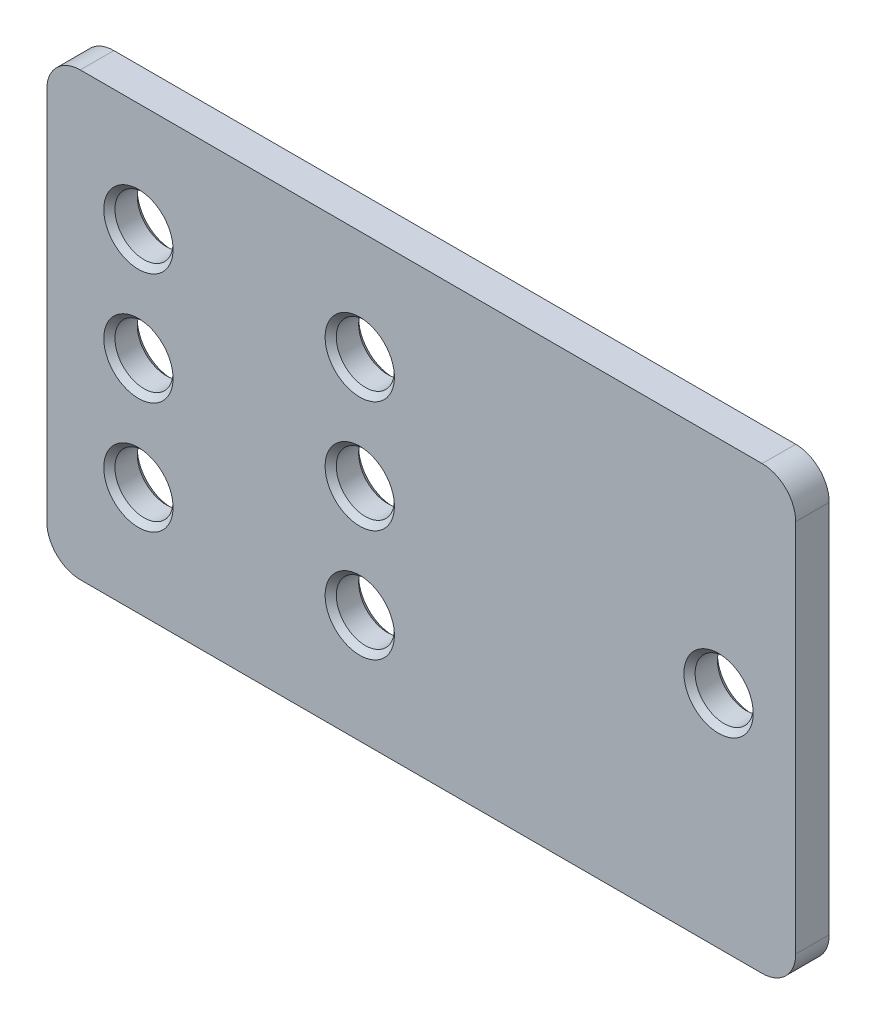
ISO-10303-21;
HEADER;
FILE_DESCRIPTION(('STEP AP214'),'2;1');
FILE_NAME('part.step','',(''),(''),'','','');
FILE_SCHEMA(('AUTOMOTIVE_DESIGN { 1 0 10303 214 1 1 1 1 }'));
ENDSEC;
DATA;
#1=APPLICATION_CONTEXT('core data for automotive mechanical design processes');
#2=APPLICATION_PROTOCOL_DEFINITION('international standard','automotive_design',2000,#1);
#3=PRODUCT_CONTEXT('',#1,'mechanical');
#4=PRODUCT('Part','Part','',(#3));
#5=PRODUCT_RELATED_PRODUCT_CATEGORY('part','',(#4));
#6=PRODUCT_DEFINITION_FORMATION('','',#4);
#7=PRODUCT_DEFINITION_CONTEXT('part definition',#1,'design');
#8=PRODUCT_DEFINITION('design','',#6,#7);
#9=PRODUCT_DEFINITION_SHAPE('','',#8);
#10=(LENGTH_UNIT() NAMED_UNIT(*) SI_UNIT(.MILLI.,.METRE.));
#11=(NAMED_UNIT(*) PLANE_ANGLE_UNIT() SI_UNIT($,.RADIAN.));
#12=(NAMED_UNIT(*) SI_UNIT($,.STERADIAN.) SOLID_ANGLE_UNIT());
#13=UNCERTAINTY_MEASURE_WITH_UNIT(LENGTH_MEASURE(1.E-05),#10,'distance_accuracy_value','');
#14=(GEOMETRIC_REPRESENTATION_CONTEXT(3) GLOBAL_UNCERTAINTY_ASSIGNED_CONTEXT((#13)) GLOBAL_UNIT_ASSIGNED_CONTEXT((#10,
#11,#12)) REPRESENTATION_CONTEXT('',''));
#15=CARTESIAN_POINT('',(0.,0.,0.));
#16=DIRECTION('',(0.,0.,1.));
#17=DIRECTION('',(1.,0.,0.));
#18=AXIS2_PLACEMENT_3D('',#15,#16,#17);
#19=CARTESIAN_POINT('',(28.5656984456913,19.4772315369713,0.702674315881723));
#20=DIRECTION('',(0.,0.,-1.));
#21=DIRECTION('',(-1.,0.,0.));
#22=AXIS2_PLACEMENT_3D('',#19,#20,#21);
#23=PLANE('',#22);
#24=CARTESIAN_POINT('',(-27.2318818992247,12.7296511920554,0.702674315881723));
#25=DIRECTION('',(0.,0.,-1.));
#26=DIRECTION('',(-1.,0.,0.));
#27=AXIS2_PLACEMENT_3D('',#24,#25,#26);
#28=CIRCLE('',#27,3.10000000000002);
#29=CARTESIAN_POINT('',(-30.3318818992247,12.7296511920554,0.702674315881723));
#30=VERTEX_POINT('',#29);
#31=EDGE_CURVE('E166',#30,#30,#28,.T.);
#32=ORIENTED_EDGE('',*,*,#31,.T.);
#33=EDGE_LOOP('',(#32));
#34=FACE_BOUND('',#33,.T.);
#35=CARTESIAN_POINT('',(-27.2318818992247,2.72965119205537,0.702674315881723));
#36=DIRECTION('',(0.,0.,-1.));
#37=DIRECTION('',(-1.,0.,0.));
#38=AXIS2_PLACEMENT_3D('',#35,#36,#37);
#39=CIRCLE('',#38,3.10000000000002);
#40=CARTESIAN_POINT('',(-30.3318818992247,2.72965119205537,0.702674315881723));
#41=VERTEX_POINT('',#40);
#42=EDGE_CURVE('E163',#41,#41,#39,.T.);
#43=ORIENTED_EDGE('',*,*,#42,.T.);
#44=EDGE_LOOP('',(#43));
#45=FACE_BOUND('',#44,.T.);
#46=CARTESIAN_POINT('',(-27.2318818992247,-7.27034880794463,0.702674315881723));
#47=DIRECTION('',(0.,0.,-1.));
#48=DIRECTION('',(-1.,0.,0.));
#49=AXIS2_PLACEMENT_3D('',#46,#47,#48);
#50=CIRCLE('',#49,3.10000000000002);
#51=CARTESIAN_POINT('',(-30.3318818992247,-7.27034880794463,0.702674315881723));
#52=VERTEX_POINT('',#51);
#53=EDGE_CURVE('E160',#52,#52,#50,.T.);
#54=ORIENTED_EDGE('',*,*,#53,.T.);
#55=EDGE_LOOP('',(#54));
#56=FACE_BOUND('',#55,.T.);
#57=CARTESIAN_POINT('',(24.6681181007753,2.72965119205537,0.702674315881723));
#58=DIRECTION('',(0.,0.,-1.));
#59=DIRECTION('',(-1.,0.,0.));
#60=AXIS2_PLACEMENT_3D('',#57,#58,#59);
#61=CIRCLE('',#60,3.10000000000001);
#62=CARTESIAN_POINT('',(21.5681181007753,2.72965119205537,0.702674315881723));
#63=VERTEX_POINT('',#62);
#64=EDGE_CURVE('E157',#63,#63,#61,.T.);
#65=ORIENTED_EDGE('',*,*,#64,.T.);
#66=EDGE_LOOP('',(#65));
#67=FACE_BOUND('',#66,.T.);
#68=CARTESIAN_POINT('',(-7.43188189922467,2.72965119205537,0.702674315881723));
#69=DIRECTION('',(0.,0.,-1.));
#70=DIRECTION('',(-1.,0.,0.));
#71=AXIS2_PLACEMENT_3D('',#68,#69,#70);
#72=CIRCLE('',#71,3.09999999999998);
#73=CARTESIAN_POINT('',(-10.5318818992246,2.72965119205537,0.702674315881723));
#74=VERTEX_POINT('',#73);
#75=EDGE_CURVE('E154',#74,#74,#72,.T.);
#76=ORIENTED_EDGE('',*,*,#75,.T.);
#77=EDGE_LOOP('',(#76));
#78=FACE_BOUND('',#77,.T.);
#79=CARTESIAN_POINT('',(-7.43188189922467,12.7296511920554,0.702674315881723));
#80=DIRECTION('',(0.,0.,-1.));
#81=DIRECTION('',(-1.,0.,0.));
#82=AXIS2_PLACEMENT_3D('',#79,#80,#81);
#83=CIRCLE('',#82,3.09999999999998);
#84=CARTESIAN_POINT('',(-10.5318818992246,12.7296511920554,0.702674315881723));
#85=VERTEX_POINT('',#84);
#86=EDGE_CURVE('E151',#85,#85,#83,.T.);
#87=ORIENTED_EDGE('',*,*,#86,.T.);
#88=EDGE_LOOP('',(#87));
#89=FACE_BOUND('',#88,.T.);
#90=CARTESIAN_POINT('',(-7.43188189922466,-7.27034880794463,0.702674315881723));
#91=DIRECTION('',(0.,0.,-1.));
#92=DIRECTION('',(-1.,0.,0.));
#93=AXIS2_PLACEMENT_3D('',#90,#91,#92);
#94=CIRCLE('',#93,3.10000000000001);
#95=CARTESIAN_POINT('',(-10.5318818992247,-7.27034880794463,0.702674315881723));
#96=VERTEX_POINT('',#95);
#97=EDGE_CURVE('E148',#96,#96,#94,.T.);
#98=ORIENTED_EDGE('',*,*,#97,.T.);
#99=EDGE_LOOP('',(#98));
#100=FACE_BOUND('',#99,.T.);
#101=CARTESIAN_POINT('',(28.5656984456913,19.4772315369713,0.702674315881723));
#102=DIRECTION('',(0.,0.,1.));
#103=DIRECTION('',(-1.,0.,0.));
#104=AXIS2_PLACEMENT_3D('',#101,#102,#103);
#105=CIRCLE('',#104,3.00241965508409);
#106=CARTESIAN_POINT('',(31.5681181007753,19.4772315369713,0.702674315881723));
#107=VERTEX_POINT('',#106);
#108=CARTESIAN_POINT('',(28.5656984456912,22.4796511920554,0.702674315881723));
#109=VERTEX_POINT('',#108);
#110=EDGE_CURVE('E127',#107,#109,#105,.T.);
#111=ORIENTED_EDGE('',*,*,#110,.T.);
#112=DIRECTION('',(-1.,0.,0.));
#113=VECTOR('',#112,1.);
#114=CARTESIAN_POINT('',(-32.4294622441406,22.4796511920554,0.702674315881723));
#115=LINE('',#114,#113);
#116=CARTESIAN_POINT('',(-32.4294622441406,22.4796511920554,0.702674315881723));
#117=VERTEX_POINT('',#116);
#118=EDGE_CURVE('E77',#109,#117,#115,.T.);
#119=ORIENTED_EDGE('',*,*,#118,.T.);
#120=CARTESIAN_POINT('',(-32.4294622441406,19.4772315369713,0.702674315881723));
#121=DIRECTION('',(0.,0.,1.));
#122=DIRECTION('',(-1.,0.,0.));
#123=AXIS2_PLACEMENT_3D('',#120,#121,#122);
#124=CIRCLE('',#123,3.00241965508409);
#125=CARTESIAN_POINT('',(-35.4318818992247,19.4772315369713,0.702674315881723));
#126=VERTEX_POINT('',#125);
#127=EDGE_CURVE('E336',#117,#126,#124,.T.);
#128=ORIENTED_EDGE('',*,*,#127,.T.);
#129=DIRECTION('',(0.,-1.,0.));
#130=VECTOR('',#129,1.);
#131=CARTESIAN_POINT('',(-35.4318818992247,19.4772315369713,0.702674315881723));
#132=LINE('',#131,#130);
#133=CARTESIAN_POINT('',(-35.4318818992247,-14.0179291528605,0.702674315881723));
#134=VERTEX_POINT('',#133);
#135=EDGE_CURVE('E340',#126,#134,#132,.T.);
#136=ORIENTED_EDGE('',*,*,#135,.T.);
#137=CARTESIAN_POINT('',(-32.4294622441406,-14.0179291528605,0.702674315881723));
#138=DIRECTION('',(0.,0.,1.));
#139=DIRECTION('',(-1.,0.,0.));
#140=AXIS2_PLACEMENT_3D('',#137,#138,#139);
#141=CIRCLE('',#140,3.00241965508409);
#142=CARTESIAN_POINT('',(-32.4294622441406,-17.0203488079446,0.702674315881723));
#143=VERTEX_POINT('',#142);
#144=EDGE_CURVE('E95',#134,#143,#141,.T.);
#145=ORIENTED_EDGE('',*,*,#144,.T.);
#146=DIRECTION('',(1.,0.,0.));
#147=VECTOR('',#146,1.);
#148=CARTESIAN_POINT('',(-32.4294622441406,-17.0203488079446,0.702674315881723));
#149=LINE('',#148,#147);
#150=CARTESIAN_POINT('',(28.5656984456912,-17.0203488079446,0.702674315881723));
#151=VERTEX_POINT('',#150);
#152=EDGE_CURVE('E90',#143,#151,#149,.T.);
#153=ORIENTED_EDGE('',*,*,#152,.T.);
#154=CARTESIAN_POINT('',(28.5656984456913,-14.0179291528605,0.702674315881723));
#155=DIRECTION('',(0.,0.,1.));
#156=DIRECTION('',(-1.,0.,0.));
#157=AXIS2_PLACEMENT_3D('',#154,#155,#156);
#158=CIRCLE('',#157,3.00241965508409);
#159=CARTESIAN_POINT('',(31.5681181007753,-14.0179291528605,0.702674315881723));
#160=VERTEX_POINT('',#159);
#161=EDGE_CURVE('E93',#151,#160,#158,.T.);
#162=ORIENTED_EDGE('',*,*,#161,.T.);
#163=DIRECTION('',(0.,1.,0.));
#164=VECTOR('',#163,1.);
#165=CARTESIAN_POINT('',(31.5681181007753,19.4772315369713,0.702674315881723));
#166=LINE('',#165,#164);
#167=EDGE_CURVE('E33',#160,#107,#166,.T.);
#168=ORIENTED_EDGE('',*,*,#167,.T.);
#169=EDGE_LOOP('',(#111,#119,#128,#136,#145,#153,#162,#168));
#170=FACE_BOUND('',#169,.T.);
#171=ADVANCED_FACE('F16',(#34,#45,#56,#67,#78,#89,#100,#170),#23,.F.);
#172=CARTESIAN_POINT('',(28.5656984456913,19.4772315369713,-2.29732568411828));
#173=DIRECTION('',(0.,0.,-1.));
#174=DIRECTION('',(-1.,0.,0.));
#175=AXIS2_PLACEMENT_3D('',#172,#173,#174);
#176=PLANE('',#175);
#177=CARTESIAN_POINT('',(-7.43188189922467,12.7296511920554,-2.29732568411828));
#178=DIRECTION('',(0.,0.,-1.));
#179=DIRECTION('',(-1.,0.,0.));
#180=AXIS2_PLACEMENT_3D('',#177,#178,#179);
#181=CIRCLE('',#180,3.1);
#182=CARTESIAN_POINT('',(-10.5318818992247,12.7296511920554,-2.29732568411828));
#183=VERTEX_POINT('',#182);
#184=EDGE_CURVE('E10',#183,#183,#181,.F.);
#185=ORIENTED_EDGE('',*,*,#184,.T.);
#186=EDGE_LOOP('',(#185));
#187=FACE_BOUND('',#186,.T.);
#188=CARTESIAN_POINT('',(-27.2318818992247,12.7296511920554,-2.29732568411828));
#189=DIRECTION('',(0.,0.,-1.));
#190=DIRECTION('',(-1.,0.,0.));
#191=AXIS2_PLACEMENT_3D('',#188,#189,#190);
#192=CIRCLE('',#191,3.09999999999998);
#193=CARTESIAN_POINT('',(-30.3318818992247,12.7296511920554,-2.29732568411828));
#194=VERTEX_POINT('',#193);
#195=EDGE_CURVE('E25',#194,#194,#192,.F.);
#196=ORIENTED_EDGE('',*,*,#195,.T.);
#197=EDGE_LOOP('',(#196));
#198=FACE_BOUND('',#197,.T.);
#199=CARTESIAN_POINT('',(-27.2318818992247,2.72965119205537,-2.29732568411828));
#200=DIRECTION('',(0.,0.,-1.));
#201=DIRECTION('',(-1.,0.,0.));
#202=AXIS2_PLACEMENT_3D('',#199,#200,#201);
#203=CIRCLE('',#202,3.09999999999998);
#204=CARTESIAN_POINT('',(-30.3318818992247,2.72965119205537,-2.29732568411828));
#205=VERTEX_POINT('',#204);
#206=EDGE_CURVE('E217',#205,#205,#203,.F.);
#207=ORIENTED_EDGE('',*,*,#206,.T.);
#208=EDGE_LOOP('',(#207));
#209=FACE_BOUND('',#208,.T.);
#210=CARTESIAN_POINT('',(-7.43188189922467,2.72965119205537,-2.29732568411828));
#211=DIRECTION('',(0.,0.,-1.));
#212=DIRECTION('',(-1.,0.,0.));
#213=AXIS2_PLACEMENT_3D('',#210,#211,#212);
#214=CIRCLE('',#213,3.1);
#215=CARTESIAN_POINT('',(-10.5318818992247,2.72965119205537,-2.29732568411828));
#216=VERTEX_POINT('',#215);
#217=EDGE_CURVE('E214',#216,#216,#214,.F.);
#218=ORIENTED_EDGE('',*,*,#217,.T.);
#219=EDGE_LOOP('',(#218));
#220=FACE_BOUND('',#219,.T.);
#221=CARTESIAN_POINT('',(24.6681181007753,2.72965119205537,-2.29732568411828));
#222=DIRECTION('',(0.,0.,-1.));
#223=DIRECTION('',(-1.,0.,0.));
#224=AXIS2_PLACEMENT_3D('',#221,#222,#223);
#225=CIRCLE('',#224,3.09999999999998);
#226=CARTESIAN_POINT('',(21.5681181007754,2.72965119205537,-2.29732568411828));
#227=VERTEX_POINT('',#226);
#228=EDGE_CURVE('E211',#227,#227,#225,.F.);
#229=ORIENTED_EDGE('',*,*,#228,.T.);
#230=EDGE_LOOP('',(#229));
#231=FACE_BOUND('',#230,.T.);
#232=CARTESIAN_POINT('',(-7.43188189922466,-7.27034880794463,-2.29732568411828));
#233=DIRECTION('',(0.,0.,-1.));
#234=DIRECTION('',(-1.,0.,0.));
#235=AXIS2_PLACEMENT_3D('',#232,#233,#234);
#236=CIRCLE('',#235,3.1);
#237=CARTESIAN_POINT('',(-10.5318818992247,-7.27034880794463,-2.29732568411828));
#238=VERTEX_POINT('',#237);
#239=EDGE_CURVE('E208',#238,#238,#236,.F.);
#240=ORIENTED_EDGE('',*,*,#239,.T.);
#241=EDGE_LOOP('',(#240));
#242=FACE_BOUND('',#241,.T.);
#243=CARTESIAN_POINT('',(-27.2318818992247,-7.27034880794463,-2.29732568411828));
#244=DIRECTION('',(0.,0.,-1.));
#245=DIRECTION('',(-1.,0.,0.));
#246=AXIS2_PLACEMENT_3D('',#243,#244,#245);
#247=CIRCLE('',#246,3.09999999999998);
#248=CARTESIAN_POINT('',(-30.3318818992246,-7.27034880794463,-2.29732568411828));
#249=VERTEX_POINT('',#248);
#250=EDGE_CURVE('E205',#249,#249,#247,.F.);
#251=ORIENTED_EDGE('',*,*,#250,.T.);
#252=EDGE_LOOP('',(#251));
#253=FACE_BOUND('',#252,.T.);
#254=CARTESIAN_POINT('',(28.5656984456913,19.4772315369713,-2.29732568411828));
#255=DIRECTION('',(0.,0.,1.));
#256=DIRECTION('',(-1.,0.,0.));
#257=AXIS2_PLACEMENT_3D('',#254,#255,#256);
#258=CIRCLE('',#257,3.00241965508409);
#259=CARTESIAN_POINT('',(31.5681181007753,19.4772315369713,-2.29732568411828));
#260=VERTEX_POINT('',#259);
#261=CARTESIAN_POINT('',(28.5656984456912,22.4796511920554,-2.29732568411828));
#262=VERTEX_POINT('',#261);
#263=EDGE_CURVE('E113',#260,#262,#258,.T.);
#264=ORIENTED_EDGE('',*,*,#263,.F.);
#265=DIRECTION('',(0.,1.,0.));
#266=VECTOR('',#265,1.);
#267=CARTESIAN_POINT('',(31.5681181007753,19.4772315369713,-2.29732568411828));
#268=LINE('',#267,#266);
#269=CARTESIAN_POINT('',(31.5681181007753,-14.0179291528605,-2.29732568411828));
#270=VERTEX_POINT('',#269);
#271=EDGE_CURVE('E68',#270,#260,#268,.T.);
#272=ORIENTED_EDGE('',*,*,#271,.F.);
#273=CARTESIAN_POINT('',(28.5656984456913,-14.0179291528605,-2.29732568411828));
#274=DIRECTION('',(0.,0.,1.));
#275=DIRECTION('',(-1.,0.,0.));
#276=AXIS2_PLACEMENT_3D('',#273,#274,#275);
#277=CIRCLE('',#276,3.00241965508409);
#278=CARTESIAN_POINT('',(28.5656984456912,-17.0203488079446,-2.29732568411828));
#279=VERTEX_POINT('',#278);
#280=EDGE_CURVE('E62',#279,#270,#277,.T.);
#281=ORIENTED_EDGE('',*,*,#280,.F.);
#282=DIRECTION('',(1.,0.,0.));
#283=VECTOR('',#282,1.);
#284=CARTESIAN_POINT('',(-32.4294622441406,-17.0203488079446,-2.29732568411828));
#285=LINE('',#284,#283);
#286=CARTESIAN_POINT('',(-32.4294622441406,-17.0203488079446,-2.29732568411828));
#287=VERTEX_POINT('',#286);
#288=EDGE_CURVE('E103',#287,#279,#285,.T.);
#289=ORIENTED_EDGE('',*,*,#288,.F.);
#290=CARTESIAN_POINT('',(-32.4294622441406,-14.0179291528605,-2.29732568411828));
#291=DIRECTION('',(0.,0.,1.));
#292=DIRECTION('',(-1.,0.,0.));
#293=AXIS2_PLACEMENT_3D('',#290,#291,#292);
#294=CIRCLE('',#293,3.00241965508409);
#295=CARTESIAN_POINT('',(-35.4318818992247,-14.0179291528605,-2.29732568411828));
#296=VERTEX_POINT('',#295);
#297=EDGE_CURVE('E122',#296,#287,#294,.T.);
#298=ORIENTED_EDGE('',*,*,#297,.F.);
#299=DIRECTION('',(0.,-1.,0.));
#300=VECTOR('',#299,1.);
#301=CARTESIAN_POINT('',(-35.4318818992247,19.4772315369713,-2.29732568411828));
#302=LINE('',#301,#300);
#303=CARTESIAN_POINT('',(-35.4318818992247,19.4772315369713,-2.29732568411828));
#304=VERTEX_POINT('',#303);
#305=EDGE_CURVE('E120',#304,#296,#302,.T.);
#306=ORIENTED_EDGE('',*,*,#305,.F.);
#307=CARTESIAN_POINT('',(-32.4294622441406,19.4772315369713,-2.29732568411828));
#308=DIRECTION('',(0.,0.,1.));
#309=DIRECTION('',(-1.,0.,0.));
#310=AXIS2_PLACEMENT_3D('',#307,#308,#309);
#311=CIRCLE('',#310,3.00241965508409);
#312=CARTESIAN_POINT('',(-32.4294622441406,22.4796511920554,-2.29732568411828));
#313=VERTEX_POINT('',#312);
#314=EDGE_CURVE('E118',#313,#304,#311,.T.);
#315=ORIENTED_EDGE('',*,*,#314,.F.);
#316=DIRECTION('',(-1.,0.,0.));
#317=VECTOR('',#316,1.);
#318=CARTESIAN_POINT('',(-32.4294622441406,22.4796511920554,-2.29732568411828));
#319=LINE('',#318,#317);
#320=EDGE_CURVE('E116',#262,#313,#319,.T.);
#321=ORIENTED_EDGE('',*,*,#320,.F.);
#322=EDGE_LOOP('',(#264,#272,#281,#289,#298,#306,#315,#321));
#323=FACE_BOUND('',#322,.T.);
#324=ADVANCED_FACE('F222',(#187,#198,#209,#220,#231,#242,#253,#323),#176,.T.);
#325=CARTESIAN_POINT('',(28.5656984456913,19.4772315369713,0.702674315881723));
#326=DIRECTION('',(0.,0.,-1.));
#327=DIRECTION('',(-1.,0.,0.));
#328=AXIS2_PLACEMENT_3D('',#325,#326,#327);
#329=CYLINDRICAL_SURFACE('',#328,3.00241965508409);
#330=ORIENTED_EDGE('',*,*,#263,.T.);
#331=DIRECTION('',(0.,0.,-1.));
#332=VECTOR('',#331,1.);
#333=CARTESIAN_POINT('',(28.5656984456912,22.4796511920554,0.702674315881723));
#334=LINE('',#333,#332);
#335=EDGE_CURVE('E140',#109,#262,#334,.T.);
#336=ORIENTED_EDGE('',*,*,#335,.F.);
#337=ORIENTED_EDGE('',*,*,#110,.F.);
#338=DIRECTION('',(0.,0.,-1.));
#339=VECTOR('',#338,1.);
#340=CARTESIAN_POINT('',(31.5681181007753,19.4772315369713,0.702674315881723));
#341=LINE('',#340,#339);
#342=EDGE_CURVE('E109',#107,#260,#341,.T.);
#343=ORIENTED_EDGE('',*,*,#342,.T.);
#344=EDGE_LOOP('',(#330,#336,#337,#343));
#345=FACE_BOUND('',#344,.T.);
#346=ADVANCED_FACE('F249',(#345),#329,.T.);
#347=CARTESIAN_POINT('',(-32.4294622441406,22.4796511920554,0.702674315881723));
#348=DIRECTION('',(0.,-1.,0.));
#349=DIRECTION('',(0.,0.,-1.));
#350=AXIS2_PLACEMENT_3D('',#347,#348,#349);
#351=PLANE('',#350);
#352=ORIENTED_EDGE('',*,*,#320,.T.);
#353=DIRECTION('',(0.,0.,-1.));
#354=VECTOR('',#353,1.);
#355=CARTESIAN_POINT('',(-32.4294622441406,22.4796511920554,0.702674315881723));
#356=LINE('',#355,#354);
#357=EDGE_CURVE('E137',#117,#313,#356,.T.);
#358=ORIENTED_EDGE('',*,*,#357,.F.);
#359=ORIENTED_EDGE('',*,*,#118,.F.);
#360=ORIENTED_EDGE('',*,*,#335,.T.);
#361=EDGE_LOOP('',(#352,#358,#359,#360));
#362=FACE_BOUND('',#361,.T.);
#363=ADVANCED_FACE('F275',(#362),#351,.F.);
#364=CARTESIAN_POINT('',(-32.4294622441406,19.4772315369713,0.702674315881723));
#365=DIRECTION('',(0.,0.,-1.));
#366=DIRECTION('',(-1.,0.,0.));
#367=AXIS2_PLACEMENT_3D('',#364,#365,#366);
#368=CYLINDRICAL_SURFACE('',#367,3.00241965508409);
#369=ORIENTED_EDGE('',*,*,#314,.T.);
#370=DIRECTION('',(0.,0.,-1.));
#371=VECTOR('',#370,1.);
#372=CARTESIAN_POINT('',(-35.4318818992247,19.4772315369713,0.702674315881723));
#373=LINE('',#372,#371);
#374=EDGE_CURVE('E134',#126,#304,#373,.T.);
#375=ORIENTED_EDGE('',*,*,#374,.F.);
#376=ORIENTED_EDGE('',*,*,#127,.F.);
#377=ORIENTED_EDGE('',*,*,#357,.T.);
#378=EDGE_LOOP('',(#369,#375,#376,#377));
#379=FACE_BOUND('',#378,.T.);
#380=ADVANCED_FACE('F271',(#379),#368,.T.);
#381=CARTESIAN_POINT('',(-35.4318818992247,19.4772315369713,0.702674315881723));
#382=DIRECTION('',(1.,0.,0.));
#383=DIRECTION('',(0.,0.,-1.));
#384=AXIS2_PLACEMENT_3D('',#381,#382,#383);
#385=PLANE('',#384);
#386=ORIENTED_EDGE('',*,*,#305,.T.);
#387=DIRECTION('',(0.,0.,-1.));
#388=VECTOR('',#387,1.);
#389=CARTESIAN_POINT('',(-35.4318818992247,-14.0179291528605,0.702674315881723));
#390=LINE('',#389,#388);
#391=EDGE_CURVE('E131',#134,#296,#390,.T.);
#392=ORIENTED_EDGE('',*,*,#391,.F.);
#393=ORIENTED_EDGE('',*,*,#135,.F.);
#394=ORIENTED_EDGE('',*,*,#374,.T.);
#395=EDGE_LOOP('',(#386,#392,#393,#394));
#396=FACE_BOUND('',#395,.T.);
#397=ADVANCED_FACE('F267',(#396),#385,.F.);
#398=CARTESIAN_POINT('',(-32.4294622441406,-14.0179291528605,0.702674315881723));
#399=DIRECTION('',(0.,0.,-1.));
#400=DIRECTION('',(-1.,0.,0.));
#401=AXIS2_PLACEMENT_3D('',#398,#399,#400);
#402=CYLINDRICAL_SURFACE('',#401,3.00241965508409);
#403=ORIENTED_EDGE('',*,*,#297,.T.);
#404=DIRECTION('',(0.,0.,-1.));
#405=VECTOR('',#404,1.);
#406=CARTESIAN_POINT('',(-32.4294622441406,-17.0203488079446,0.702674315881723));
#407=LINE('',#406,#405);
#408=EDGE_CURVE('E104',#143,#287,#407,.T.);
#409=ORIENTED_EDGE('',*,*,#408,.F.);
#410=ORIENTED_EDGE('',*,*,#144,.F.);
#411=ORIENTED_EDGE('',*,*,#391,.T.);
#412=EDGE_LOOP('',(#403,#409,#410,#411));
#413=FACE_BOUND('',#412,.T.);
#414=ADVANCED_FACE('F264',(#413),#402,.T.);
#415=CARTESIAN_POINT('',(-32.4294622441406,-17.0203488079446,0.702674315881723));
#416=DIRECTION('',(0.,1.,0.));
#417=DIRECTION('',(0.,0.,1.));
#418=AXIS2_PLACEMENT_3D('',#415,#416,#417);
#419=PLANE('',#418);
#420=ORIENTED_EDGE('',*,*,#288,.T.);
#421=DIRECTION('',(0.,0.,-1.));
#422=VECTOR('',#421,1.);
#423=CARTESIAN_POINT('',(28.5656984456912,-17.0203488079446,0.702674315881723));
#424=LINE('',#423,#422);
#425=EDGE_CURVE('E100',#151,#279,#424,.T.);
#426=ORIENTED_EDGE('',*,*,#425,.F.);
#427=ORIENTED_EDGE('',*,*,#152,.F.);
#428=ORIENTED_EDGE('',*,*,#408,.T.);
#429=EDGE_LOOP('',(#420,#426,#427,#428));
#430=FACE_BOUND('',#429,.T.);
#431=ADVANCED_FACE('F101',(#430),#419,.F.);
#432=CARTESIAN_POINT('',(28.5656984456913,-14.0179291528605,0.702674315881723));
#433=DIRECTION('',(0.,0.,-1.));
#434=DIRECTION('',(-1.,0.,0.));
#435=AXIS2_PLACEMENT_3D('',#432,#433,#434);
#436=CYLINDRICAL_SURFACE('',#435,3.00241965508409);
#437=ORIENTED_EDGE('',*,*,#280,.T.);
#438=DIRECTION('',(0.,0.,-1.));
#439=VECTOR('',#438,1.);
#440=CARTESIAN_POINT('',(31.5681181007753,-14.0179291528605,0.702674315881723));
#441=LINE('',#440,#439);
#442=EDGE_CURVE('E105',#160,#270,#441,.T.);
#443=ORIENTED_EDGE('',*,*,#442,.F.);
#444=ORIENTED_EDGE('',*,*,#161,.F.);
#445=ORIENTED_EDGE('',*,*,#425,.T.);
#446=EDGE_LOOP('',(#437,#443,#444,#445));
#447=FACE_BOUND('',#446,.T.);
#448=ADVANCED_FACE('F107',(#447),#436,.T.);
#449=CARTESIAN_POINT('',(31.5681181007753,19.4772315369713,0.702674315881723));
#450=DIRECTION('',(-1.,0.,0.));
#451=DIRECTION('',(0.,0.,1.));
#452=AXIS2_PLACEMENT_3D('',#449,#450,#451);
#453=PLANE('',#452);
#454=ORIENTED_EDGE('',*,*,#271,.T.);
#455=ORIENTED_EDGE('',*,*,#342,.F.);
#456=ORIENTED_EDGE('',*,*,#167,.F.);
#457=ORIENTED_EDGE('',*,*,#442,.T.);
#458=EDGE_LOOP('',(#454,#455,#456,#457));
#459=FACE_BOUND('',#458,.T.);
#460=ADVANCED_FACE('F257',(#459),#453,.F.);
#461=CARTESIAN_POINT('',(24.6681181007753,2.72965119205537,0.702674315881723));
#462=DIRECTION('',(0.,0.,-1.));
#463=DIRECTION('',(-1.,0.,0.));
#464=AXIS2_PLACEMENT_3D('',#461,#462,#463);
#465=CYLINDRICAL_SURFACE('',#464,2.6);
#466=CARTESIAN_POINT('',(24.6681181007753,2.72965119205537,0.202674315881721));
#467=DIRECTION('',(0.,0.,-1.));
#468=DIRECTION('',(-1.,0.,0.));
#469=AXIS2_PLACEMENT_3D('',#466,#467,#468);
#470=CIRCLE('',#469,2.6);
#471=CARTESIAN_POINT('',(22.0681181007753,2.72965119205537,0.202674315881721));
#472=VERTEX_POINT('',#471);
#473=EDGE_CURVE('E184',#472,#472,#470,.F.);
#474=ORIENTED_EDGE('',*,*,#473,.T.);
#475=EDGE_LOOP('',(#474));
#476=FACE_BOUND('',#475,.T.);
#477=CARTESIAN_POINT('',(24.6681181007753,2.72965119205537,-1.79732568411828));
#478=DIRECTION('',(0.,0.,-1.));
#479=DIRECTION('',(-1.,0.,0.));
#480=AXIS2_PLACEMENT_3D('',#477,#478,#479);
#481=CIRCLE('',#480,2.6);
#482=CARTESIAN_POINT('',(22.0681181007753,2.72965119205537,-1.79732568411828));
#483=VERTEX_POINT('',#482);
#484=EDGE_CURVE('E181',#483,#483,#481,.T.);
#485=ORIENTED_EDGE('',*,*,#484,.T.);
#486=EDGE_LOOP('',(#485));
#487=FACE_BOUND('',#486,.T.);
#488=ADVANCED_FACE('F254',(#476,#487),#465,.F.);
#489=CARTESIAN_POINT('',(-7.43188189922467,2.72965119205537,0.702674315881723));
#490=DIRECTION('',(0.,0.,-1.));
#491=DIRECTION('',(-1.,0.,0.));
#492=AXIS2_PLACEMENT_3D('',#489,#490,#491);
#493=CYLINDRICAL_SURFACE('',#492,2.6);
#494=CARTESIAN_POINT('',(-7.43188189922467,2.72965119205537,0.202674315881743));
#495=DIRECTION('',(0.,0.,-1.));
#496=DIRECTION('',(-1.,0.,0.));
#497=AXIS2_PLACEMENT_3D('',#494,#495,#496);
#498=CIRCLE('',#497,2.6);
#499=CARTESIAN_POINT('',(-10.0318818992247,2.72965119205537,0.202674315881743));
#500=VERTEX_POINT('',#499);
#501=EDGE_CURVE('E190',#500,#500,#498,.F.);
#502=ORIENTED_EDGE('',*,*,#501,.T.);
#503=EDGE_LOOP('',(#502));
#504=FACE_BOUND('',#503,.T.);
#505=CARTESIAN_POINT('',(-7.43188189922467,2.72965119205537,-1.79732568411827));
#506=DIRECTION('',(0.,0.,-1.));
#507=DIRECTION('',(-1.,0.,0.));
#508=AXIS2_PLACEMENT_3D('',#505,#506,#507);
#509=CIRCLE('',#508,2.6);
#510=CARTESIAN_POINT('',(-10.0318818992247,2.72965119205537,-1.79732568411827));
#511=VERTEX_POINT('',#510);
#512=EDGE_CURVE('E187',#511,#511,#509,.T.);
#513=ORIENTED_EDGE('',*,*,#512,.T.);
#514=EDGE_LOOP('',(#513));
#515=FACE_BOUND('',#514,.T.);
#516=ADVANCED_FACE('F369',(#504,#515),#493,.F.);
#517=CARTESIAN_POINT('',(-27.2318818992247,2.72965119205537,0.702674315881723));
#518=DIRECTION('',(0.,0.,-1.));
#519=DIRECTION('',(-1.,0.,0.));
#520=AXIS2_PLACEMENT_3D('',#517,#518,#519);
#521=CYLINDRICAL_SURFACE('',#520,2.6);
#522=CARTESIAN_POINT('',(-27.2318818992247,2.72965119205537,0.202674315881707));
#523=DIRECTION('',(0.,0.,-1.));
#524=DIRECTION('',(-1.,0.,0.));
#525=AXIS2_PLACEMENT_3D('',#522,#523,#524);
#526=CIRCLE('',#525,2.6);
#527=CARTESIAN_POINT('',(-29.8318818992247,2.72965119205537,0.202674315881707));
#528=VERTEX_POINT('',#527);
#529=EDGE_CURVE('E172',#528,#528,#526,.F.);
#530=ORIENTED_EDGE('',*,*,#529,.T.);
#531=EDGE_LOOP('',(#530));
#532=FACE_BOUND('',#531,.T.);
#533=CARTESIAN_POINT('',(-27.2318818992247,2.72965119205537,-1.79732568411828));
#534=DIRECTION('',(0.,0.,-1.));
#535=DIRECTION('',(-1.,0.,0.));
#536=AXIS2_PLACEMENT_3D('',#533,#534,#535);
#537=CIRCLE('',#536,2.6);
#538=CARTESIAN_POINT('',(-29.8318818992247,2.72965119205537,-1.79732568411828));
#539=VERTEX_POINT('',#538);
#540=EDGE_CURVE('E169',#539,#539,#537,.T.);
#541=ORIENTED_EDGE('',*,*,#540,.T.);
#542=EDGE_LOOP('',(#541));
#543=FACE_BOUND('',#542,.T.);
#544=ADVANCED_FACE('F366',(#532,#543),#521,.F.);
#545=CARTESIAN_POINT('',(-27.2318818992247,12.7296511920554,0.702674315881723));
#546=DIRECTION('',(0.,0.,-1.));
#547=DIRECTION('',(-1.,0.,0.));
#548=AXIS2_PLACEMENT_3D('',#545,#546,#547);
#549=CYLINDRICAL_SURFACE('',#548,2.6);
#550=CARTESIAN_POINT('',(-27.2318818992247,12.7296511920554,0.202674315881707));
#551=DIRECTION('',(0.,0.,-1.));
#552=DIRECTION('',(-1.,0.,0.));
#553=AXIS2_PLACEMENT_3D('',#550,#551,#552);
#554=CIRCLE('',#553,2.6);
#555=CARTESIAN_POINT('',(-29.8318818992247,12.7296511920554,0.202674315881707));
#556=VERTEX_POINT('',#555);
#557=EDGE_CURVE('E145',#556,#556,#554,.F.);
#558=ORIENTED_EDGE('',*,*,#557,.T.);
#559=EDGE_LOOP('',(#558));
#560=FACE_BOUND('',#559,.T.);
#561=CARTESIAN_POINT('',(-27.2318818992247,12.7296511920554,-1.79732568411828));
#562=DIRECTION('',(0.,0.,-1.));
#563=DIRECTION('',(-1.,0.,0.));
#564=AXIS2_PLACEMENT_3D('',#561,#562,#563);
#565=CIRCLE('',#564,2.6);
#566=CARTESIAN_POINT('',(-29.8318818992247,12.7296511920554,-1.79732568411828));
#567=VERTEX_POINT('',#566);
#568=EDGE_CURVE('E142',#567,#567,#565,.T.);
#569=ORIENTED_EDGE('',*,*,#568,.T.);
#570=EDGE_LOOP('',(#569));
#571=FACE_BOUND('',#570,.T.);
#572=ADVANCED_FACE('F362',(#560,#571),#549,.F.);
#573=CARTESIAN_POINT('',(-7.43188189922467,12.7296511920554,0.702674315881723));
#574=DIRECTION('',(0.,0.,-1.));
#575=DIRECTION('',(-1.,0.,0.));
#576=AXIS2_PLACEMENT_3D('',#573,#574,#575);
#577=CYLINDRICAL_SURFACE('',#576,2.6);
#578=CARTESIAN_POINT('',(-7.43188189922467,12.7296511920554,0.202674315881742));
#579=DIRECTION('',(0.,0.,-1.));
#580=DIRECTION('',(-1.,0.,0.));
#581=AXIS2_PLACEMENT_3D('',#578,#579,#580);
#582=CIRCLE('',#581,2.6);
#583=CARTESIAN_POINT('',(-10.0318818992247,12.7296511920554,0.202674315881742));
#584=VERTEX_POINT('',#583);
#585=EDGE_CURVE('E196',#584,#584,#582,.F.);
#586=ORIENTED_EDGE('',*,*,#585,.T.);
#587=EDGE_LOOP('',(#586));
#588=FACE_BOUND('',#587,.T.);
#589=CARTESIAN_POINT('',(-7.43188189922467,12.7296511920554,-1.79732568411827));
#590=DIRECTION('',(0.,0.,-1.));
#591=DIRECTION('',(-1.,0.,0.));
#592=AXIS2_PLACEMENT_3D('',#589,#590,#591);
#593=CIRCLE('',#592,2.6);
#594=CARTESIAN_POINT('',(-10.0318818992247,12.7296511920554,-1.79732568411827));
#595=VERTEX_POINT('',#594);
#596=EDGE_CURVE('E193',#595,#595,#593,.T.);
#597=ORIENTED_EDGE('',*,*,#596,.T.);
#598=EDGE_LOOP('',(#597));
#599=FACE_BOUND('',#598,.T.);
#600=ADVANCED_FACE('F318',(#588,#599),#577,.F.);
#601=CARTESIAN_POINT('',(-7.43188189922466,-7.27034880794463,0.702674315881723));
#602=DIRECTION('',(0.,0.,-1.));
#603=DIRECTION('',(-1.,0.,0.));
#604=AXIS2_PLACEMENT_3D('',#601,#602,#603);
#605=CYLINDRICAL_SURFACE('',#604,2.6);
#606=CARTESIAN_POINT('',(-7.43188189922466,-7.27034880794463,0.202674315881723));
#607=DIRECTION('',(0.,0.,-1.));
#608=DIRECTION('',(-1.,0.,0.));
#609=AXIS2_PLACEMENT_3D('',#606,#607,#608);
#610=CIRCLE('',#609,2.6);
#611=CARTESIAN_POINT('',(-10.0318818992247,-7.27034880794463,0.202674315881723));
#612=VERTEX_POINT('',#611);
#613=EDGE_CURVE('E202',#612,#612,#610,.F.);
#614=ORIENTED_EDGE('',*,*,#613,.T.);
#615=EDGE_LOOP('',(#614));
#616=FACE_BOUND('',#615,.T.);
#617=CARTESIAN_POINT('',(-7.43188189922466,-7.27034880794463,-1.79732568411827));
#618=DIRECTION('',(0.,0.,-1.));
#619=DIRECTION('',(-1.,0.,0.));
#620=AXIS2_PLACEMENT_3D('',#617,#618,#619);
#621=CIRCLE('',#620,2.6);
#622=CARTESIAN_POINT('',(-10.0318818992247,-7.27034880794463,-1.79732568411827));
#623=VERTEX_POINT('',#622);
#624=EDGE_CURVE('E199',#623,#623,#621,.T.);
#625=ORIENTED_EDGE('',*,*,#624,.T.);
#626=EDGE_LOOP('',(#625));
#627=FACE_BOUND('',#626,.T.);
#628=ADVANCED_FACE('F315',(#616,#627),#605,.F.);
#629=CARTESIAN_POINT('',(-27.2318818992247,-7.27034880794463,0.702674315881723));
#630=DIRECTION('',(0.,0.,-1.));
#631=DIRECTION('',(-1.,0.,0.));
#632=AXIS2_PLACEMENT_3D('',#629,#630,#631);
#633=CYLINDRICAL_SURFACE('',#632,2.6);
#634=CARTESIAN_POINT('',(-27.2318818992247,-7.27034880794463,0.202674315881707));
#635=DIRECTION('',(0.,0.,-1.));
#636=DIRECTION('',(-1.,0.,0.));
#637=AXIS2_PLACEMENT_3D('',#634,#635,#636);
#638=CIRCLE('',#637,2.6);
#639=CARTESIAN_POINT('',(-29.8318818992247,-7.27034880794463,0.202674315881707));
#640=VERTEX_POINT('',#639);
#641=EDGE_CURVE('E178',#640,#640,#638,.F.);
#642=ORIENTED_EDGE('',*,*,#641,.T.);
#643=EDGE_LOOP('',(#642));
#644=FACE_BOUND('',#643,.T.);
#645=CARTESIAN_POINT('',(-27.2318818992247,-7.27034880794463,-1.79732568411828));
#646=DIRECTION('',(0.,0.,-1.));
#647=DIRECTION('',(-1.,0.,0.));
#648=AXIS2_PLACEMENT_3D('',#645,#646,#647);
#649=CIRCLE('',#648,2.6);
#650=CARTESIAN_POINT('',(-29.8318818992247,-7.27034880794463,-1.79732568411828));
#651=VERTEX_POINT('',#650);
#652=EDGE_CURVE('E175',#651,#651,#649,.T.);
#653=ORIENTED_EDGE('',*,*,#652,.T.);
#654=EDGE_LOOP('',(#653));
#655=FACE_BOUND('',#654,.T.);
#656=ADVANCED_FACE('F286',(#644,#655),#633,.F.);
#657=CARTESIAN_POINT('',(-27.2318818992247,12.7296511920554,0.202674315881707));
#658=DIRECTION('',(0.,0.,1.));
#659=DIRECTION('',(1.,0.,0.));
#660=AXIS2_PLACEMENT_3D('',#657,#658,#659);
#661=CONICAL_SURFACE('',#660,2.6,0.785398163397453);
#662=ORIENTED_EDGE('',*,*,#31,.F.);
#663=EDGE_LOOP('',(#662));
#664=FACE_BOUND('',#663,.T.);
#665=ORIENTED_EDGE('',*,*,#557,.F.);
#666=EDGE_LOOP('',(#665));
#667=FACE_BOUND('',#666,.T.);
#668=ADVANCED_FACE('F282',(#664,#667),#661,.F.);
#669=CARTESIAN_POINT('',(-27.2318818992247,2.72965119205537,0.202674315881707));
#670=DIRECTION('',(0.,0.,1.));
#671=DIRECTION('',(1.,0.,0.));
#672=AXIS2_PLACEMENT_3D('',#669,#670,#671);
#673=CONICAL_SURFACE('',#672,2.6,0.785398163397453);
#674=ORIENTED_EDGE('',*,*,#42,.F.);
#675=EDGE_LOOP('',(#674));
#676=FACE_BOUND('',#675,.T.);
#677=ORIENTED_EDGE('',*,*,#529,.F.);
#678=EDGE_LOOP('',(#677));
#679=FACE_BOUND('',#678,.T.);
#680=ADVANCED_FACE('F285',(#676,#679),#673,.F.);
#681=CARTESIAN_POINT('',(-27.2318818992247,-7.27034880794463,0.202674315881707));
#682=DIRECTION('',(0.,0.,1.));
#683=DIRECTION('',(1.,0.,0.));
#684=AXIS2_PLACEMENT_3D('',#681,#682,#683);
#685=CONICAL_SURFACE('',#684,2.6,0.785398163397453);
#686=ORIENTED_EDGE('',*,*,#53,.F.);
#687=EDGE_LOOP('',(#686));
#688=FACE_BOUND('',#687,.T.);
#689=ORIENTED_EDGE('',*,*,#641,.F.);
#690=EDGE_LOOP('',(#689));
#691=FACE_BOUND('',#690,.T.);
#692=ADVANCED_FACE('F290',(#688,#691),#685,.F.);
#693=CARTESIAN_POINT('',(24.6681181007753,2.72965119205537,0.202674315881721));
#694=DIRECTION('',(0.,0.,1.));
#695=DIRECTION('',(1.,0.,0.));
#696=AXIS2_PLACEMENT_3D('',#693,#694,#695);
#697=CONICAL_SURFACE('',#696,2.6,0.785398163397453);
#698=ORIENTED_EDGE('',*,*,#64,.F.);
#699=EDGE_LOOP('',(#698));
#700=FACE_BOUND('',#699,.T.);
#701=ORIENTED_EDGE('',*,*,#473,.F.);
#702=EDGE_LOOP('',(#701));
#703=FACE_BOUND('',#702,.T.);
#704=ADVANCED_FACE('F294',(#700,#703),#697,.F.);
#705=CARTESIAN_POINT('',(-7.43188189922467,2.72965119205537,0.202674315881743));
#706=DIRECTION('',(0.,0.,1.));
#707=DIRECTION('',(1.,0.,0.));
#708=AXIS2_PLACEMENT_3D('',#705,#706,#707);
#709=CONICAL_SURFACE('',#708,2.6,0.785398163397453);
#710=ORIENTED_EDGE('',*,*,#75,.F.);
#711=EDGE_LOOP('',(#710));
#712=FACE_BOUND('',#711,.T.);
#713=ORIENTED_EDGE('',*,*,#501,.F.);
#714=EDGE_LOOP('',(#713));
#715=FACE_BOUND('',#714,.T.);
#716=ADVANCED_FACE('F298',(#712,#715),#709,.F.);
#717=CARTESIAN_POINT('',(-7.43188189922467,12.7296511920554,0.202674315881742));
#718=DIRECTION('',(0.,0.,1.));
#719=DIRECTION('',(1.,0.,0.));
#720=AXIS2_PLACEMENT_3D('',#717,#718,#719);
#721=CONICAL_SURFACE('',#720,2.6,0.785398163397453);
#722=ORIENTED_EDGE('',*,*,#86,.F.);
#723=EDGE_LOOP('',(#722));
#724=FACE_BOUND('',#723,.T.);
#725=ORIENTED_EDGE('',*,*,#585,.F.);
#726=EDGE_LOOP('',(#725));
#727=FACE_BOUND('',#726,.T.);
#728=ADVANCED_FACE('F302',(#724,#727),#721,.F.);
#729=CARTESIAN_POINT('',(-7.43188189922466,-7.27034880794463,0.202674315881723));
#730=DIRECTION('',(0.,0.,1.));
#731=DIRECTION('',(1.,0.,0.));
#732=AXIS2_PLACEMENT_3D('',#729,#730,#731);
#733=CONICAL_SURFACE('',#732,2.6,0.785398163397453);
#734=ORIENTED_EDGE('',*,*,#97,.F.);
#735=EDGE_LOOP('',(#734));
#736=FACE_BOUND('',#735,.T.);
#737=ORIENTED_EDGE('',*,*,#613,.F.);
#738=EDGE_LOOP('',(#737));
#739=FACE_BOUND('',#738,.T.);
#740=ADVANCED_FACE('F239',(#736,#739),#733,.F.);
#741=CARTESIAN_POINT('',(-7.43188189922467,12.7296511920554,-2.29732568411828));
#742=DIRECTION('',(0.,0.,-1.));
#743=DIRECTION('',(-1.,0.,0.));
#744=AXIS2_PLACEMENT_3D('',#741,#742,#743);
#745=CONICAL_SURFACE('',#744,3.1,0.785398163397444);
#746=ORIENTED_EDGE('',*,*,#596,.F.);
#747=EDGE_LOOP('',(#746));
#748=FACE_BOUND('',#747,.T.);
#749=ORIENTED_EDGE('',*,*,#184,.F.);
#750=EDGE_LOOP('',(#749));
#751=FACE_BOUND('',#750,.T.);
#752=ADVANCED_FACE('F228',(#748,#751),#745,.F.);
#753=CARTESIAN_POINT('',(-27.2318818992247,12.7296511920554,-2.29732568411828));
#754=DIRECTION('',(0.,0.,-1.));
#755=DIRECTION('',(-1.,0.,0.));
#756=AXIS2_PLACEMENT_3D('',#753,#754,#755);
#757=CONICAL_SURFACE('',#756,3.09999999999998,0.785398163397441);
#758=ORIENTED_EDGE('',*,*,#568,.F.);
#759=EDGE_LOOP('',(#758));
#760=FACE_BOUND('',#759,.T.);
#761=ORIENTED_EDGE('',*,*,#195,.F.);
#762=EDGE_LOOP('',(#761));
#763=FACE_BOUND('',#762,.T.);
#764=ADVANCED_FACE('F225',(#760,#763),#757,.F.);
#765=CARTESIAN_POINT('',(-27.2318818992247,2.72965119205537,-2.29732568411828));
#766=DIRECTION('',(0.,0.,-1.));
#767=DIRECTION('',(-1.,0.,0.));
#768=AXIS2_PLACEMENT_3D('',#765,#766,#767);
#769=CONICAL_SURFACE('',#768,3.09999999999998,0.785398163397441);
#770=ORIENTED_EDGE('',*,*,#540,.F.);
#771=EDGE_LOOP('',(#770));
#772=FACE_BOUND('',#771,.T.);
#773=ORIENTED_EDGE('',*,*,#206,.F.);
#774=EDGE_LOOP('',(#773));
#775=FACE_BOUND('',#774,.T.);
#776=ADVANCED_FACE('F227',(#772,#775),#769,.F.);
#777=CARTESIAN_POINT('',(-7.43188189922467,2.72965119205537,-2.29732568411828));
#778=DIRECTION('',(0.,0.,-1.));
#779=DIRECTION('',(-1.,0.,0.));
#780=AXIS2_PLACEMENT_3D('',#777,#778,#779);
#781=CONICAL_SURFACE('',#780,3.1,0.785398163397444);
#782=ORIENTED_EDGE('',*,*,#512,.F.);
#783=EDGE_LOOP('',(#782));
#784=FACE_BOUND('',#783,.T.);
#785=ORIENTED_EDGE('',*,*,#217,.F.);
#786=EDGE_LOOP('',(#785));
#787=FACE_BOUND('',#786,.T.);
#788=ADVANCED_FACE('F236',(#784,#787),#781,.F.);
#789=CARTESIAN_POINT('',(24.6681181007753,2.72965119205537,-2.29732568411828));
#790=DIRECTION('',(0.,0.,-1.));
#791=DIRECTION('',(-1.,0.,0.));
#792=AXIS2_PLACEMENT_3D('',#789,#790,#791);
#793=CONICAL_SURFACE('',#792,3.09999999999998,0.785398163397441);
#794=ORIENTED_EDGE('',*,*,#484,.F.);
#795=EDGE_LOOP('',(#794));
#796=FACE_BOUND('',#795,.T.);
#797=ORIENTED_EDGE('',*,*,#228,.F.);
#798=EDGE_LOOP('',(#797));
#799=FACE_BOUND('',#798,.T.);
#800=ADVANCED_FACE('F325',(#796,#799),#793,.F.);
#801=CARTESIAN_POINT('',(-7.43188189922466,-7.27034880794463,-2.29732568411828));
#802=DIRECTION('',(0.,0.,-1.));
#803=DIRECTION('',(-1.,0.,0.));
#804=AXIS2_PLACEMENT_3D('',#801,#802,#803);
#805=CONICAL_SURFACE('',#804,3.1,0.785398163397444);
#806=ORIENTED_EDGE('',*,*,#624,.F.);
#807=EDGE_LOOP('',(#806));
#808=FACE_BOUND('',#807,.T.);
#809=ORIENTED_EDGE('',*,*,#239,.F.);
#810=EDGE_LOOP('',(#809));
#811=FACE_BOUND('',#810,.T.);
#812=ADVANCED_FACE('F322',(#808,#811),#805,.F.);
#813=CARTESIAN_POINT('',(-27.2318818992247,-7.27034880794463,-2.29732568411828));
#814=DIRECTION('',(0.,0.,-1.));
#815=DIRECTION('',(-1.,0.,0.));
#816=AXIS2_PLACEMENT_3D('',#813,#814,#815);
#817=CONICAL_SURFACE('',#816,3.09999999999998,0.785398163397441);
#818=ORIENTED_EDGE('',*,*,#652,.F.);
#819=EDGE_LOOP('',(#818));
#820=FACE_BOUND('',#819,.T.);
#821=ORIENTED_EDGE('',*,*,#250,.F.);
#822=EDGE_LOOP('',(#821));
#823=FACE_BOUND('',#822,.T.);
#824=ADVANCED_FACE('F18',(#820,#823),#817,.F.);
#825=CLOSED_SHELL('',(#171,#324,#346,#363,#380,#397,#414,#431,#448,#460,#488,#516,#544,#572,
#600,#628,#656,#668,#680,#692,#704,#716,#728,#740,#752,#764,#776,#788,#800,#812,#824));
#826=MANIFOLD_SOLID_BREP('B1',#825);
#827=ADVANCED_BREP_SHAPE_REPRESENTATION('',(#18,#826),#14);
#828=SHAPE_DEFINITION_REPRESENTATION(#9,#827);
ENDSEC;
END-ISO-10303-21;
